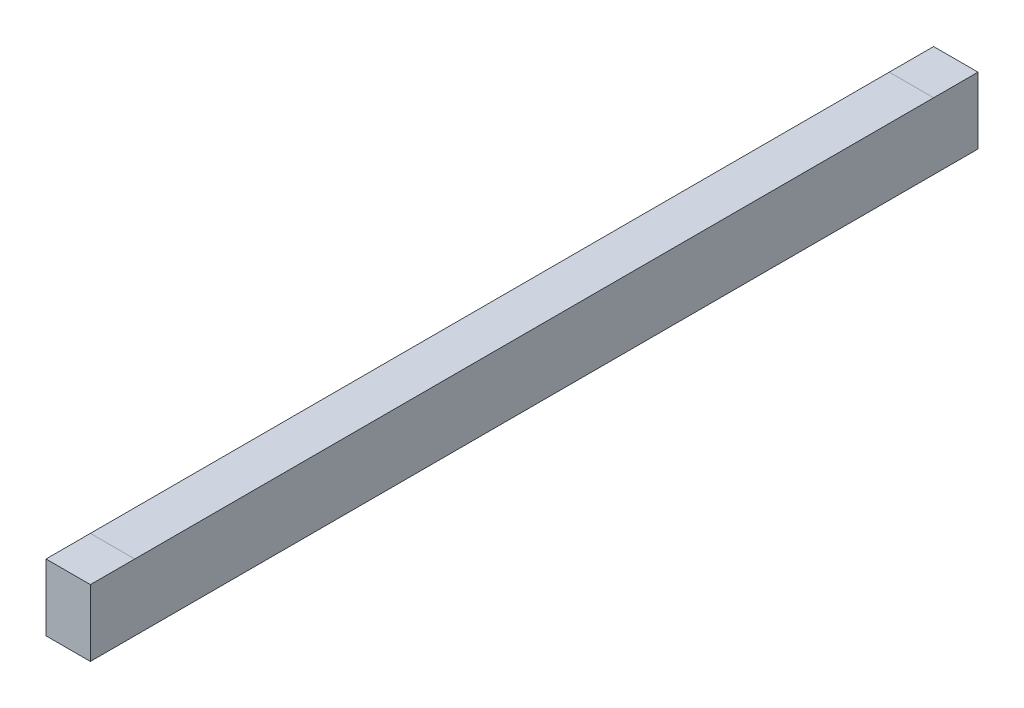
ISO-10303-21;
HEADER;
FILE_DESCRIPTION(('STEP AP214'),'2;1');
FILE_NAME('part.step','',(''),(''),'','','');
FILE_SCHEMA(('AUTOMOTIVE_DESIGN { 1 0 10303 214 1 1 1 1 }'));
ENDSEC;
DATA;
#1=APPLICATION_CONTEXT('core data for automotive mechanical design processes');
#2=APPLICATION_PROTOCOL_DEFINITION('international standard','automotive_design',2000,#1);
#3=PRODUCT_CONTEXT('',#1,'mechanical');
#4=PRODUCT('Part','Part','',(#3));
#5=PRODUCT_RELATED_PRODUCT_CATEGORY('part','',(#4));
#6=PRODUCT_DEFINITION_FORMATION('','',#4);
#7=PRODUCT_DEFINITION_CONTEXT('part definition',#1,'design');
#8=PRODUCT_DEFINITION('design','',#6,#7);
#9=PRODUCT_DEFINITION_SHAPE('','',#8);
#10=(LENGTH_UNIT() NAMED_UNIT(*) SI_UNIT(.MILLI.,.METRE.));
#11=(NAMED_UNIT(*) PLANE_ANGLE_UNIT() SI_UNIT($,.RADIAN.));
#12=(NAMED_UNIT(*) SI_UNIT($,.STERADIAN.) SOLID_ANGLE_UNIT());
#13=UNCERTAINTY_MEASURE_WITH_UNIT(LENGTH_MEASURE(1.E-05),#10,'distance_accuracy_value','');
#14=(GEOMETRIC_REPRESENTATION_CONTEXT(3) GLOBAL_UNCERTAINTY_ASSIGNED_CONTEXT((#13)) GLOBAL_UNIT_ASSIGNED_CONTEXT((#10,
#11,#12)) REPRESENTATION_CONTEXT('',''));
#15=CARTESIAN_POINT('',(0.,0.,0.));
#16=DIRECTION('',(0.,0.,1.));
#17=DIRECTION('',(1.,0.,0.));
#18=AXIS2_PLACEMENT_3D('',#15,#16,#17);
#19=CARTESIAN_POINT('',(0.,0.,2000.));
#20=DIRECTION('',(0.,1.,0.));
#21=DIRECTION('',(0.,0.,1.));
#22=AXIS2_PLACEMENT_3D('',#19,#20,#21);
#23=PLANE('',#22);
#24=DIRECTION('',(-1.,0.,0.));
#25=VECTOR('',#24,1.);
#26=CARTESIAN_POINT('',(0.,0.,100.));
#27=LINE('',#26,#25);
#28=CARTESIAN_POINT('',(100.,0.,100.));
#29=VERTEX_POINT('',#28);
#30=CARTESIAN_POINT('',(0.,0.,100.));
#31=VERTEX_POINT('',#30);
#32=EDGE_CURVE('E11',#29,#31,#27,.T.);
#33=ORIENTED_EDGE('',*,*,#32,.F.);
#34=DIRECTION('',(0.,0.,-1.));
#35=VECTOR('',#34,1.);
#36=CARTESIAN_POINT('',(100.,0.,2000.));
#37=LINE('',#36,#35);
#38=CARTESIAN_POINT('',(100.,0.,1900.));
#39=VERTEX_POINT('',#38);
#40=EDGE_CURVE('E146',#39,#29,#37,.T.);
#41=ORIENTED_EDGE('',*,*,#40,.F.);
#42=DIRECTION('',(-1.,0.,0.));
#43=VECTOR('',#42,1.);
#44=CARTESIAN_POINT('',(0.,0.,1900.));
#45=LINE('',#44,#43);
#46=CARTESIAN_POINT('',(0.,0.,1900.));
#47=VERTEX_POINT('',#46);
#48=EDGE_CURVE('E138',#39,#47,#45,.T.);
#49=ORIENTED_EDGE('',*,*,#48,.T.);
#50=DIRECTION('',(0.,0.,-1.));
#51=VECTOR('',#50,1.);
#52=CARTESIAN_POINT('',(0.,0.,2000.));
#53=LINE('',#52,#51);
#54=EDGE_CURVE('E131',#47,#31,#53,.T.);
#55=ORIENTED_EDGE('',*,*,#54,.T.);
#56=EDGE_LOOP('',(#33,#41,#49,#55));
#57=FACE_BOUND('',#56,.T.);
#58=ADVANCED_FACE('F43',(#57),#23,.F.);
#59=CARTESIAN_POINT('',(0.,150.,2000.));
#60=DIRECTION('',(0.,-1.,0.));
#61=DIRECTION('',(0.,0.,-1.));
#62=AXIS2_PLACEMENT_3D('',#59,#60,#61);
#63=PLANE('',#62);
#64=DIRECTION('',(1.,0.,0.));
#65=VECTOR('',#64,1.);
#66=CARTESIAN_POINT('',(0.,150.,100.));
#67=LINE('',#66,#65);
#68=CARTESIAN_POINT('',(0.,150.,100.));
#69=VERTEX_POINT('',#68);
#70=CARTESIAN_POINT('',(100.,150.,100.));
#71=VERTEX_POINT('',#70);
#72=EDGE_CURVE('E47',#69,#71,#67,.T.);
#73=ORIENTED_EDGE('',*,*,#72,.F.);
#74=DIRECTION('',(0.,0.,-1.));
#75=VECTOR('',#74,1.);
#76=CARTESIAN_POINT('',(0.,150.,2000.));
#77=LINE('',#76,#75);
#78=CARTESIAN_POINT('',(0.,150.,1900.));
#79=VERTEX_POINT('',#78);
#80=EDGE_CURVE('E170',#79,#69,#77,.T.);
#81=ORIENTED_EDGE('',*,*,#80,.F.);
#82=DIRECTION('',(1.,0.,0.));
#83=VECTOR('',#82,1.);
#84=CARTESIAN_POINT('',(0.,150.,1900.));
#85=LINE('',#84,#83);
#86=CARTESIAN_POINT('',(100.,150.,1900.));
#87=VERTEX_POINT('',#86);
#88=EDGE_CURVE('E133',#79,#87,#85,.T.);
#89=ORIENTED_EDGE('',*,*,#88,.T.);
#90=DIRECTION('',(0.,0.,-1.));
#91=VECTOR('',#90,1.);
#92=CARTESIAN_POINT('',(100.,150.,2000.));
#93=LINE('',#92,#91);
#94=EDGE_CURVE('E157',#87,#71,#93,.T.);
#95=ORIENTED_EDGE('',*,*,#94,.T.);
#96=EDGE_LOOP('',(#73,#81,#89,#95));
#97=FACE_BOUND('',#96,.T.);
#98=ADVANCED_FACE('F205',(#97),#63,.F.);
#99=ORIENTED_EDGE('',*,*,#48,.F.);
#100=CARTESIAN_POINT('',(100.,0.,2000.));
#101=VERTEX_POINT('',#100);
#102=EDGE_CURVE('E112',#101,#39,#37,.T.);
#103=ORIENTED_EDGE('',*,*,#102,.F.);
#104=DIRECTION('',(1.,0.,0.));
#105=VECTOR('',#104,1.);
#106=CARTESIAN_POINT('',(0.,0.,2000.));
#107=LINE('',#106,#105);
#108=CARTESIAN_POINT('',(0.,0.,2000.));
#109=VERTEX_POINT('',#108);
#110=EDGE_CURVE('E106',#109,#101,#107,.T.);
#111=ORIENTED_EDGE('',*,*,#110,.F.);
#112=EDGE_CURVE('E110',#109,#47,#53,.T.);
#113=ORIENTED_EDGE('',*,*,#112,.T.);
#114=EDGE_LOOP('',(#99,#103,#111,#113));
#115=FACE_BOUND('',#114,.T.);
#116=ADVANCED_FACE('F108',(#115),#23,.F.);
#117=ORIENTED_EDGE('',*,*,#88,.F.);
#118=CARTESIAN_POINT('',(0.,150.,2000.));
#119=VERTEX_POINT('',#118);
#120=EDGE_CURVE('E165',#119,#79,#77,.T.);
#121=ORIENTED_EDGE('',*,*,#120,.F.);
#122=DIRECTION('',(-1.,0.,0.));
#123=VECTOR('',#122,1.);
#124=CARTESIAN_POINT('',(0.,150.,2000.));
#125=LINE('',#124,#123);
#126=CARTESIAN_POINT('',(100.,150.,2000.));
#127=VERTEX_POINT('',#126);
#128=EDGE_CURVE('E122',#127,#119,#125,.T.);
#129=ORIENTED_EDGE('',*,*,#128,.F.);
#130=EDGE_CURVE('E153',#127,#87,#93,.T.);
#131=ORIENTED_EDGE('',*,*,#130,.T.);
#132=EDGE_LOOP('',(#117,#121,#129,#131));
#133=FACE_BOUND('',#132,.T.);
#134=ADVANCED_FACE('F206',(#133),#63,.F.);
#135=CARTESIAN_POINT('',(0.,0.,2000.));
#136=DIRECTION('',(1.,0.,0.));
#137=DIRECTION('',(0.,0.,-1.));
#138=AXIS2_PLACEMENT_3D('',#135,#136,#137);
#139=PLANE('',#138);
#140=DIRECTION('',(0.,-1.,0.));
#141=VECTOR('',#140,1.);
#142=CARTESIAN_POINT('',(0.,0.,0.));
#143=LINE('',#142,#141);
#144=CARTESIAN_POINT('',(0.,150.,0.));
#145=VERTEX_POINT('',#144);
#146=CARTESIAN_POINT('',(0.,0.,0.));
#147=VERTEX_POINT('',#146);
#148=EDGE_CURVE('E182',#145,#147,#143,.T.);
#149=ORIENTED_EDGE('',*,*,#148,.T.);
#150=EDGE_CURVE('E135',#31,#147,#53,.T.);
#151=ORIENTED_EDGE('',*,*,#150,.F.);
#152=ORIENTED_EDGE('',*,*,#54,.F.);
#153=ORIENTED_EDGE('',*,*,#112,.F.);
#154=DIRECTION('',(0.,-1.,0.));
#155=VECTOR('',#154,1.);
#156=CARTESIAN_POINT('',(0.,0.,2000.));
#157=LINE('',#156,#155);
#158=EDGE_CURVE('E117',#119,#109,#157,.T.);
#159=ORIENTED_EDGE('',*,*,#158,.F.);
#160=ORIENTED_EDGE('',*,*,#120,.T.);
#161=ORIENTED_EDGE('',*,*,#80,.T.);
#162=EDGE_CURVE('E171',#69,#145,#77,.T.);
#163=ORIENTED_EDGE('',*,*,#162,.T.);
#164=EDGE_LOOP('',(#149,#151,#152,#153,#159,#160,#161,#163));
#165=FACE_BOUND('',#164,.T.);
#166=ADVANCED_FACE('F45',(#165),#139,.F.);
#167=CARTESIAN_POINT('',(100.,0.,0.));
#168=VERTEX_POINT('',#167);
#169=EDGE_CURVE('E147',#29,#168,#37,.T.);
#170=ORIENTED_EDGE('',*,*,#169,.F.);
#171=ORIENTED_EDGE('',*,*,#32,.T.);
#172=ORIENTED_EDGE('',*,*,#150,.T.);
#173=DIRECTION('',(1.,0.,0.));
#174=VECTOR('',#173,1.);
#175=CARTESIAN_POINT('',(0.,0.,0.));
#176=LINE('',#175,#174);
#177=EDGE_CURVE('E185',#147,#168,#176,.T.);
#178=ORIENTED_EDGE('',*,*,#177,.T.);
#179=EDGE_LOOP('',(#170,#171,#172,#178));
#180=FACE_BOUND('',#179,.T.);
#181=ADVANCED_FACE('F213',(#180),#23,.F.);
#182=CARTESIAN_POINT('',(100.,0.,2000.));
#183=DIRECTION('',(-1.,0.,0.));
#184=DIRECTION('',(0.,0.,1.));
#185=AXIS2_PLACEMENT_3D('',#182,#183,#184);
#186=PLANE('',#185);
#187=DIRECTION('',(0.,1.,0.));
#188=VECTOR('',#187,1.);
#189=CARTESIAN_POINT('',(100.,0.,0.));
#190=LINE('',#189,#188);
#191=CARTESIAN_POINT('',(100.,150.,0.));
#192=VERTEX_POINT('',#191);
#193=EDGE_CURVE('E188',#168,#192,#190,.T.);
#194=ORIENTED_EDGE('',*,*,#193,.T.);
#195=EDGE_CURVE('E158',#71,#192,#93,.T.);
#196=ORIENTED_EDGE('',*,*,#195,.F.);
#197=ORIENTED_EDGE('',*,*,#94,.F.);
#198=ORIENTED_EDGE('',*,*,#130,.F.);
#199=DIRECTION('',(0.,1.,0.));
#200=VECTOR('',#199,1.);
#201=CARTESIAN_POINT('',(100.,0.,2000.));
#202=LINE('',#201,#200);
#203=EDGE_CURVE('E116',#101,#127,#202,.T.);
#204=ORIENTED_EDGE('',*,*,#203,.F.);
#205=ORIENTED_EDGE('',*,*,#102,.T.);
#206=ORIENTED_EDGE('',*,*,#40,.T.);
#207=ORIENTED_EDGE('',*,*,#169,.T.);
#208=EDGE_LOOP('',(#194,#196,#197,#198,#204,#205,#206,#207));
#209=FACE_BOUND('',#208,.T.);
#210=ADVANCED_FACE('F204',(#209),#186,.F.);
#211=ORIENTED_EDGE('',*,*,#162,.F.);
#212=ORIENTED_EDGE('',*,*,#72,.T.);
#213=ORIENTED_EDGE('',*,*,#195,.T.);
#214=DIRECTION('',(-1.,0.,0.));
#215=VECTOR('',#214,1.);
#216=CARTESIAN_POINT('',(0.,150.,0.));
#217=LINE('',#216,#215);
#218=EDGE_CURVE('E127',#192,#145,#217,.T.);
#219=ORIENTED_EDGE('',*,*,#218,.T.);
#220=EDGE_LOOP('',(#211,#212,#213,#219));
#221=FACE_BOUND('',#220,.T.);
#222=ADVANCED_FACE('F193',(#221),#63,.F.);
#223=CARTESIAN_POINT('',(0.,0.,2000.));
#224=DIRECTION('',(0.,0.,-1.));
#225=DIRECTION('',(-1.,0.,0.));
#226=AXIS2_PLACEMENT_3D('',#223,#224,#225);
#227=PLANE('',#226);
#228=ORIENTED_EDGE('',*,*,#158,.T.);
#229=ORIENTED_EDGE('',*,*,#110,.T.);
#230=ORIENTED_EDGE('',*,*,#203,.T.);
#231=ORIENTED_EDGE('',*,*,#128,.T.);
#232=EDGE_LOOP('',(#228,#229,#230,#231));
#233=FACE_BOUND('',#232,.T.);
#234=ADVANCED_FACE('F120',(#233),#227,.F.);
#235=CARTESIAN_POINT('',(0.,0.,0.));
#236=DIRECTION('',(0.,0.,-1.));
#237=DIRECTION('',(-1.,0.,0.));
#238=AXIS2_PLACEMENT_3D('',#235,#236,#237);
#239=PLANE('',#238);
#240=ORIENTED_EDGE('',*,*,#148,.F.);
#241=ORIENTED_EDGE('',*,*,#218,.F.);
#242=ORIENTED_EDGE('',*,*,#193,.F.);
#243=ORIENTED_EDGE('',*,*,#177,.F.);
#244=EDGE_LOOP('',(#240,#241,#242,#243));
#245=FACE_BOUND('',#244,.T.);
#246=ADVANCED_FACE('F196',(#245),#239,.T.);
#247=CLOSED_SHELL('',(#58,#98,#116,#134,#166,#181,#210,#222,#234,#246));
#248=MANIFOLD_SOLID_BREP('B2',#247);
#249=ADVANCED_BREP_SHAPE_REPRESENTATION('',(#18,#248),#14);
#250=SHAPE_DEFINITION_REPRESENTATION(#9,#249);
ENDSEC;
END-ISO-10303-21;
